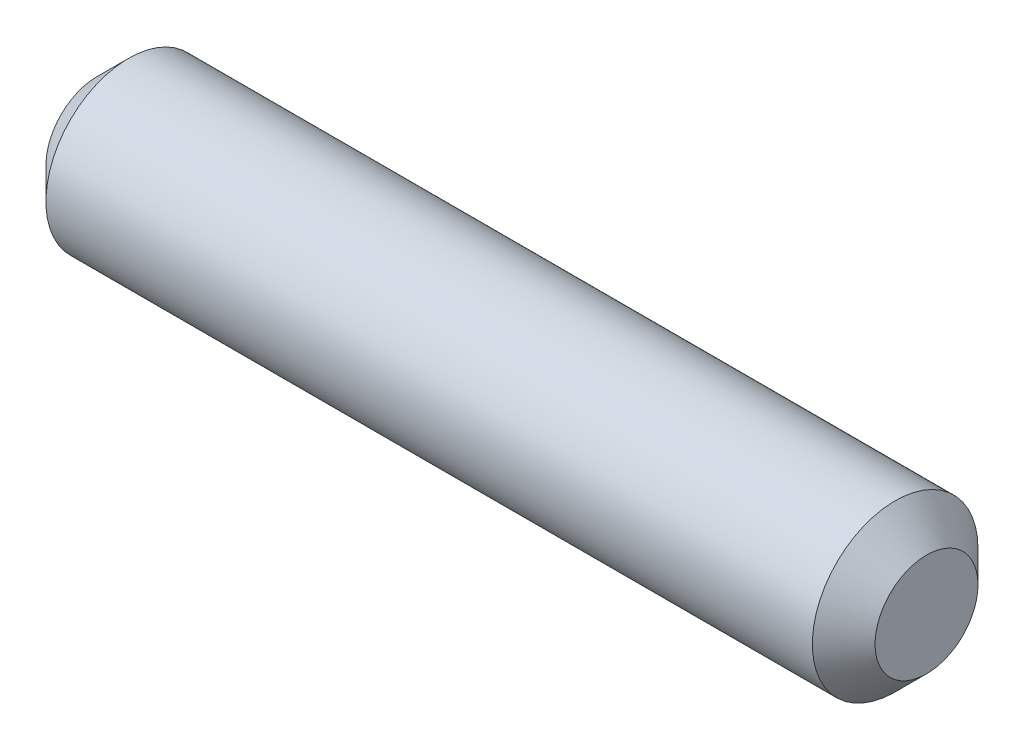
ISO-10303-21;
HEADER;
FILE_DESCRIPTION(('STEP AP214'),'2;1');
FILE_NAME('part.step','',(''),(''),'','','');
FILE_SCHEMA(('AUTOMOTIVE_DESIGN { 1 0 10303 214 1 1 1 1 }'));
ENDSEC;
DATA;
#1=APPLICATION_CONTEXT('core data for automotive mechanical design processes');
#2=APPLICATION_PROTOCOL_DEFINITION('international standard','automotive_design',2000,#1);
#3=PRODUCT_CONTEXT('',#1,'mechanical');
#4=PRODUCT('Part','Part','',(#3));
#5=PRODUCT_RELATED_PRODUCT_CATEGORY('part','',(#4));
#6=PRODUCT_DEFINITION_FORMATION('','',#4);
#7=PRODUCT_DEFINITION_CONTEXT('part definition',#1,'design');
#8=PRODUCT_DEFINITION('design','',#6,#7);
#9=PRODUCT_DEFINITION_SHAPE('','',#8);
#10=(LENGTH_UNIT() NAMED_UNIT(*) SI_UNIT(.MILLI.,.METRE.));
#11=(NAMED_UNIT(*) PLANE_ANGLE_UNIT() SI_UNIT($,.RADIAN.));
#12=(NAMED_UNIT(*) SI_UNIT($,.STERADIAN.) SOLID_ANGLE_UNIT());
#13=UNCERTAINTY_MEASURE_WITH_UNIT(LENGTH_MEASURE(1.E-05),#10,'distance_accuracy_value','');
#14=(GEOMETRIC_REPRESENTATION_CONTEXT(3) GLOBAL_UNCERTAINTY_ASSIGNED_CONTEXT((#13)) GLOBAL_UNIT_ASSIGNED_CONTEXT((#10,
#11,#12)) REPRESENTATION_CONTEXT('',''));
#15=CARTESIAN_POINT('',(0.,0.,0.));
#16=DIRECTION('',(0.,0.,1.));
#17=DIRECTION('',(1.,0.,0.));
#18=AXIS2_PLACEMENT_3D('',#15,#16,#17);
#19=CARTESIAN_POINT('',(7.935,0.,0.));
#20=DIRECTION('',(-1.,0.,0.));
#21=DIRECTION('',(0.,0.,1.));
#22=AXIS2_PLACEMENT_3D('',#19,#20,#21);
#23=CYLINDRICAL_SURFACE('',#22,1.585);
#24=CARTESIAN_POINT('',(-7.335,0.,0.));
#25=DIRECTION('',(1.,0.,0.));
#26=DIRECTION('',(0.,0.,-1.));
#27=AXIS2_PLACEMENT_3D('',#24,#25,#26);
#28=CIRCLE('',#27,1.585);
#29=CARTESIAN_POINT('',(-7.335,0.,-1.585));
#30=VERTEX_POINT('',#29);
#31=EDGE_CURVE('E57',#30,#30,#28,.T.);
#32=ORIENTED_EDGE('',*,*,#31,.T.);
#33=EDGE_LOOP('',(#32));
#34=FACE_BOUND('',#33,.T.);
#35=CARTESIAN_POINT('',(7.335,0.,0.));
#36=DIRECTION('',(1.,0.,0.));
#37=DIRECTION('',(0.,0.,-1.));
#38=AXIS2_PLACEMENT_3D('',#35,#36,#37);
#39=CIRCLE('',#38,1.585);
#40=CARTESIAN_POINT('',(7.335,0.,-1.585));
#41=VERTEX_POINT('',#40);
#42=EDGE_CURVE('E62',#41,#41,#39,.F.);
#43=ORIENTED_EDGE('',*,*,#42,.T.);
#44=EDGE_LOOP('',(#43));
#45=FACE_BOUND('',#44,.T.);
#46=ADVANCED_FACE('F43',(#34,#45),#23,.T.);
#47=CARTESIAN_POINT('',(7.935,0.,0.));
#48=DIRECTION('',(1.,0.,0.));
#49=DIRECTION('',(0.,0.,-1.));
#50=AXIS2_PLACEMENT_3D('',#47,#48,#49);
#51=PLANE('',#50);
#52=CARTESIAN_POINT('',(7.935,0.,0.));
#53=DIRECTION('',(1.,0.,0.));
#54=DIRECTION('',(0.,0.,-1.));
#55=AXIS2_PLACEMENT_3D('',#52,#53,#54);
#56=CIRCLE('',#55,0.984999999999998);
#57=CARTESIAN_POINT('',(7.935,0.,-0.984999999999998));
#58=VERTEX_POINT('',#57);
#59=EDGE_CURVE('E10',#58,#58,#56,.T.);
#60=ORIENTED_EDGE('',*,*,#59,.T.);
#61=EDGE_LOOP('',(#60));
#62=FACE_BOUND('',#61,.T.);
#63=ADVANCED_FACE('F79',(#62),#51,.T.);
#64=CARTESIAN_POINT('',(-7.935,0.,0.));
#65=DIRECTION('',(1.,0.,0.));
#66=DIRECTION('',(0.,0.,-1.));
#67=AXIS2_PLACEMENT_3D('',#64,#65,#66);
#68=PLANE('',#67);
#69=CARTESIAN_POINT('',(-7.935,0.,0.));
#70=DIRECTION('',(1.,0.,0.));
#71=DIRECTION('',(0.,0.,-1.));
#72=AXIS2_PLACEMENT_3D('',#69,#70,#71);
#73=CIRCLE('',#72,0.984999999999998);
#74=CARTESIAN_POINT('',(-7.935,0.,-0.984999999999998));
#75=VERTEX_POINT('',#74);
#76=EDGE_CURVE('E52',#75,#75,#73,.F.);
#77=ORIENTED_EDGE('',*,*,#76,.T.);
#78=EDGE_LOOP('',(#77));
#79=FACE_BOUND('',#78,.T.);
#80=ADVANCED_FACE('F76',(#79),#68,.F.);
#81=CARTESIAN_POINT('',(-7.335,0.,0.));
#82=DIRECTION('',(1.,0.,0.));
#83=DIRECTION('',(0.,0.,-1.));
#84=AXIS2_PLACEMENT_3D('',#81,#82,#83);
#85=CONICAL_SURFACE('',#84,1.585,0.785398163397449);
#86=ORIENTED_EDGE('',*,*,#76,.F.);
#87=EDGE_LOOP('',(#86));
#88=FACE_BOUND('',#87,.T.);
#89=ORIENTED_EDGE('',*,*,#31,.F.);
#90=EDGE_LOOP('',(#89));
#91=FACE_BOUND('',#90,.T.);
#92=ADVANCED_FACE('F72',(#88,#91),#85,.T.);
#93=CARTESIAN_POINT('',(7.935,0.,0.));
#94=DIRECTION('',(-1.,0.,0.));
#95=DIRECTION('',(0.,0.,1.));
#96=AXIS2_PLACEMENT_3D('',#93,#94,#95);
#97=CONICAL_SURFACE('',#96,0.984999999999998,0.785398163397448);
#98=ORIENTED_EDGE('',*,*,#42,.F.);
#99=EDGE_LOOP('',(#98));
#100=FACE_BOUND('',#99,.T.);
#101=ORIENTED_EDGE('',*,*,#59,.F.);
#102=EDGE_LOOP('',(#101));
#103=FACE_BOUND('',#102,.T.);
#104=ADVANCED_FACE('F46',(#100,#103),#97,.T.);
#105=CLOSED_SHELL('',(#46,#63,#80,#92,#104));
#106=MANIFOLD_SOLID_BREP('B2',#105);
#107=ADVANCED_BREP_SHAPE_REPRESENTATION('',(#18,#106),#14);
#108=SHAPE_DEFINITION_REPRESENTATION(#9,#107);
ENDSEC;
END-ISO-10303-21;
